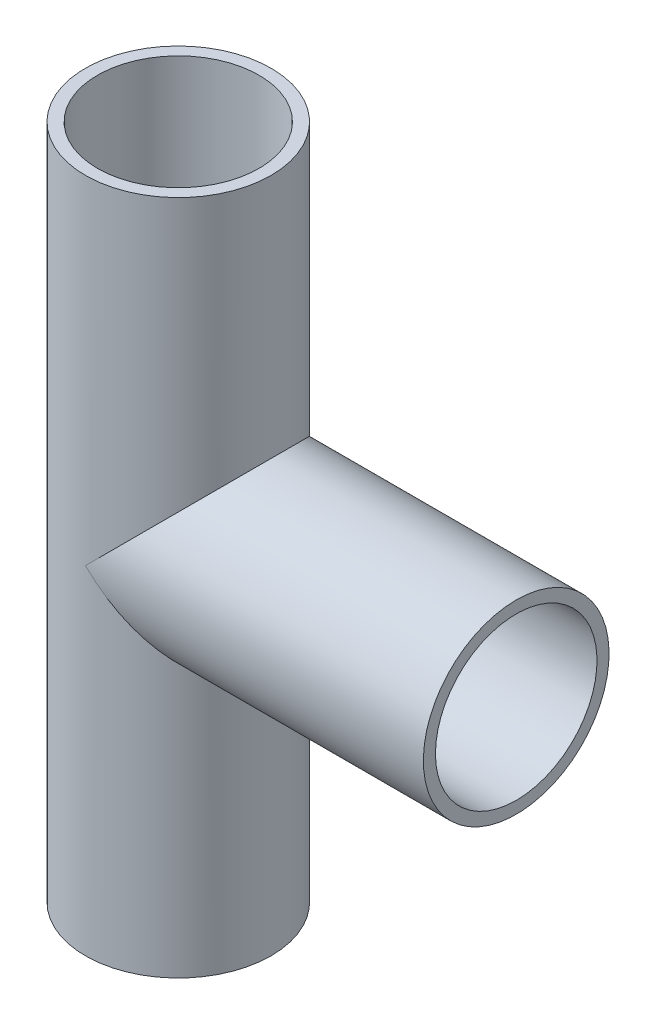
ISO-10303-21;
HEADER;
FILE_DESCRIPTION(('STEP AP214'),'2;1');
FILE_NAME('part.step','',(''),(''),'','','');
FILE_SCHEMA(('AUTOMOTIVE_DESIGN { 1 0 10303 214 1 1 1 1 }'));
ENDSEC;
DATA;
#1=APPLICATION_CONTEXT('core data for automotive mechanical design processes');
#2=APPLICATION_PROTOCOL_DEFINITION('international standard','automotive_design',2000,#1);
#3=PRODUCT_CONTEXT('',#1,'mechanical');
#4=PRODUCT('Part','Part','',(#3));
#5=PRODUCT_RELATED_PRODUCT_CATEGORY('part','',(#4));
#6=PRODUCT_DEFINITION_FORMATION('','',#4);
#7=PRODUCT_DEFINITION_CONTEXT('part definition',#1,'design');
#8=PRODUCT_DEFINITION('design','',#6,#7);
#9=PRODUCT_DEFINITION_SHAPE('','',#8);
#10=(LENGTH_UNIT() NAMED_UNIT(*) SI_UNIT(.MILLI.,.METRE.));
#11=(NAMED_UNIT(*) PLANE_ANGLE_UNIT() SI_UNIT($,.RADIAN.));
#12=(NAMED_UNIT(*) SI_UNIT($,.STERADIAN.) SOLID_ANGLE_UNIT());
#13=UNCERTAINTY_MEASURE_WITH_UNIT(LENGTH_MEASURE(1.E-05),#10,'distance_accuracy_value','');
#14=(GEOMETRIC_REPRESENTATION_CONTEXT(3) GLOBAL_UNCERTAINTY_ASSIGNED_CONTEXT((#13)) GLOBAL_UNIT_ASSIGNED_CONTEXT((#10,
#11,#12)) REPRESENTATION_CONTEXT('',''));
#15=CARTESIAN_POINT('',(0.,0.,0.));
#16=DIRECTION('',(0.,0.,1.));
#17=DIRECTION('',(1.,0.,0.));
#18=AXIS2_PLACEMENT_3D('',#15,#16,#17);
#19=CARTESIAN_POINT('',(0.,-46.228,0.));
#20=DIRECTION('',(0.,-1.,0.));
#21=DIRECTION('',(0.,0.,1.));
#22=AXIS2_PLACEMENT_3D('',#19,#20,#21);
#23=CYLINDRICAL_SURFACE('',#22,12.7);
#24=CARTESIAN_POINT('',(0.,0.,0.));
#25=DIRECTION('',(0.707106781186548,-0.707106781186548,0.));
#26=DIRECTION('',(0.707106781186548,0.707106781186548,0.));
#27=AXIS2_PLACEMENT_3D('',#24,#25,#26);
#28=ELLIPSE('',#27,17.9605122421383,12.7);
#29=CARTESIAN_POINT('',(0.,0.,-12.7));
#30=VERTEX_POINT('',#29);
#31=CARTESIAN_POINT('',(0.,0.,12.7));
#32=VERTEX_POINT('',#31);
#33=EDGE_CURVE('E34',#30,#32,#28,.T.);
#34=ORIENTED_EDGE('',*,*,#33,.F.);
#35=CARTESIAN_POINT('',(0.,0.,0.));
#36=DIRECTION('',(0.707106781186548,0.707106781186548,0.));
#37=DIRECTION('',(-0.707106781186548,0.707106781186548,0.));
#38=AXIS2_PLACEMENT_3D('',#35,#36,#37);
#39=ELLIPSE('',#38,17.9605122421383,12.7);
#40=EDGE_CURVE('E60',#32,#30,#39,.T.);
#41=ORIENTED_EDGE('',*,*,#40,.F.);
#42=EDGE_LOOP('',(#34,#41));
#43=FACE_BOUND('',#42,.T.);
#44=CARTESIAN_POINT('',(0.,-46.228,0.));
#45=DIRECTION('',(0.,1.,0.));
#46=DIRECTION('',(1.,0.,0.));
#47=AXIS2_PLACEMENT_3D('',#44,#45,#46);
#48=CIRCLE('',#47,12.7);
#49=CARTESIAN_POINT('',(12.7,-46.228,0.));
#50=VERTEX_POINT('',#49);
#51=EDGE_CURVE('E11',#50,#50,#48,.T.);
#52=ORIENTED_EDGE('',*,*,#51,.T.);
#53=EDGE_LOOP('',(#52));
#54=FACE_BOUND('',#53,.T.);
#55=CARTESIAN_POINT('',(0.,46.228,0.));
#56=DIRECTION('',(0.,1.,0.));
#57=DIRECTION('',(1.,0.,0.));
#58=AXIS2_PLACEMENT_3D('',#55,#56,#57);
#59=CIRCLE('',#58,12.7);
#60=CARTESIAN_POINT('',(12.7,46.228,0.));
#61=VERTEX_POINT('',#60);
#62=EDGE_CURVE('E55',#61,#61,#59,.T.);
#63=ORIENTED_EDGE('',*,*,#62,.F.);
#64=EDGE_LOOP('',(#63));
#65=FACE_BOUND('',#64,.T.);
#66=ADVANCED_FACE('F16',(#43,#54,#65),#23,.T.);
#67=CARTESIAN_POINT('',(46.228,0.,0.));
#68=DIRECTION('',(1.,0.,0.));
#69=DIRECTION('',(0.,0.,1.));
#70=AXIS2_PLACEMENT_3D('',#67,#68,#69);
#71=CYLINDRICAL_SURFACE('',#70,11.049);
#72=CARTESIAN_POINT('',(46.228,0.,0.));
#73=DIRECTION('',(-1.,0.,0.));
#74=DIRECTION('',(0.,-1.,0.));
#75=AXIS2_PLACEMENT_3D('',#72,#73,#74);
#76=CIRCLE('',#75,11.049);
#77=CARTESIAN_POINT('',(46.228,-11.049,0.));
#78=VERTEX_POINT('',#77);
#79=EDGE_CURVE('E65',#78,#78,#76,.T.);
#80=ORIENTED_EDGE('',*,*,#79,.F.);
#81=EDGE_LOOP('',(#80));
#82=FACE_BOUND('',#81,.T.);
#83=CARTESIAN_POINT('',(0.,0.,0.));
#84=DIRECTION('',(0.707106781186548,0.707106781186548,0.));
#85=DIRECTION('',(-0.707106781186548,0.707106781186548,0.));
#86=AXIS2_PLACEMENT_3D('',#83,#84,#85);
#87=ELLIPSE('',#86,15.6256456506603,11.049);
#88=CARTESIAN_POINT('',(0.,0.,11.049));
#89=VERTEX_POINT('',#88);
#90=CARTESIAN_POINT('',(0.,0.,-11.049));
#91=VERTEX_POINT('',#90);
#92=EDGE_CURVE('E42',#89,#91,#87,.T.);
#93=ORIENTED_EDGE('',*,*,#92,.F.);
#94=CARTESIAN_POINT('',(0.,0.,0.));
#95=DIRECTION('',(0.707106781186548,-0.707106781186548,0.));
#96=DIRECTION('',(0.707106781186548,0.707106781186548,0.));
#97=AXIS2_PLACEMENT_3D('',#94,#95,#96);
#98=ELLIPSE('',#97,15.6256456506603,11.049);
#99=EDGE_CURVE('E26',#91,#89,#98,.T.);
#100=ORIENTED_EDGE('',*,*,#99,.F.);
#101=EDGE_LOOP('',(#93,#100));
#102=FACE_BOUND('',#101,.T.);
#103=ADVANCED_FACE('F49',(#82,#102),#71,.F.);
#104=CARTESIAN_POINT('',(0.,-46.228,0.));
#105=DIRECTION('',(0.,-1.,0.));
#106=DIRECTION('',(0.,0.,1.));
#107=AXIS2_PLACEMENT_3D('',#104,#105,#106);
#108=CYLINDRICAL_SURFACE('',#107,11.049);
#109=ORIENTED_EDGE('',*,*,#99,.T.);
#110=ORIENTED_EDGE('',*,*,#92,.T.);
#111=EDGE_LOOP('',(#109,#110));
#112=FACE_BOUND('',#111,.T.);
#113=CARTESIAN_POINT('',(0.,-46.228,0.));
#114=DIRECTION('',(0.,1.,0.));
#115=DIRECTION('',(0.,0.,1.));
#116=AXIS2_PLACEMENT_3D('',#113,#114,#115);
#117=CIRCLE('',#116,11.049);
#118=CARTESIAN_POINT('',(0.,-46.228,11.049));
#119=VERTEX_POINT('',#118);
#120=EDGE_CURVE('E53',#119,#119,#117,.T.);
#121=ORIENTED_EDGE('',*,*,#120,.F.);
#122=EDGE_LOOP('',(#121));
#123=FACE_BOUND('',#122,.T.);
#124=CARTESIAN_POINT('',(0.,46.228,0.));
#125=DIRECTION('',(0.,1.,0.));
#126=DIRECTION('',(0.,0.,1.));
#127=AXIS2_PLACEMENT_3D('',#124,#125,#126);
#128=CIRCLE('',#127,11.049);
#129=CARTESIAN_POINT('',(0.,46.228,11.049));
#130=VERTEX_POINT('',#129);
#131=EDGE_CURVE('E47',#130,#130,#128,.T.);
#132=ORIENTED_EDGE('',*,*,#131,.T.);
#133=EDGE_LOOP('',(#132));
#134=FACE_BOUND('',#133,.T.);
#135=ADVANCED_FACE('F45',(#112,#123,#134),#108,.F.);
#136=CARTESIAN_POINT('',(46.228,0.,0.));
#137=DIRECTION('',(1.,0.,0.));
#138=DIRECTION('',(0.,0.,1.));
#139=AXIS2_PLACEMENT_3D('',#136,#137,#138);
#140=CYLINDRICAL_SURFACE('',#139,12.7);
#141=CARTESIAN_POINT('',(46.228,0.,0.));
#142=DIRECTION('',(-1.,0.,0.));
#143=DIRECTION('',(0.,1.,0.));
#144=AXIS2_PLACEMENT_3D('',#141,#142,#143);
#145=CIRCLE('',#144,12.7);
#146=CARTESIAN_POINT('',(46.228,12.7,0.));
#147=VERTEX_POINT('',#146);
#148=EDGE_CURVE('E20',#147,#147,#145,.T.);
#149=ORIENTED_EDGE('',*,*,#148,.T.);
#150=EDGE_LOOP('',(#149));
#151=FACE_BOUND('',#150,.T.);
#152=ORIENTED_EDGE('',*,*,#40,.T.);
#153=ORIENTED_EDGE('',*,*,#33,.T.);
#154=EDGE_LOOP('',(#152,#153));
#155=FACE_BOUND('',#154,.T.);
#156=ADVANCED_FACE('F82',(#151,#155),#140,.T.);
#157=CARTESIAN_POINT('',(46.228,0.,0.));
#158=DIRECTION('',(-1.,0.,0.));
#159=DIRECTION('',(0.,-1.,0.));
#160=AXIS2_PLACEMENT_3D('',#157,#158,#159);
#161=PLANE('',#160);
#162=ORIENTED_EDGE('',*,*,#79,.T.);
#163=EDGE_LOOP('',(#162));
#164=FACE_BOUND('',#163,.T.);
#165=ORIENTED_EDGE('',*,*,#148,.F.);
#166=EDGE_LOOP('',(#165));
#167=FACE_BOUND('',#166,.T.);
#168=ADVANCED_FACE('F72',(#164,#167),#161,.F.);
#169=CARTESIAN_POINT('',(0.,46.228,0.));
#170=DIRECTION('',(0.,1.,0.));
#171=DIRECTION('',(0.,0.,1.));
#172=AXIS2_PLACEMENT_3D('',#169,#170,#171);
#173=PLANE('',#172);
#174=ORIENTED_EDGE('',*,*,#131,.F.);
#175=EDGE_LOOP('',(#174));
#176=FACE_BOUND('',#175,.T.);
#177=ORIENTED_EDGE('',*,*,#62,.T.);
#178=EDGE_LOOP('',(#177));
#179=FACE_BOUND('',#178,.T.);
#180=ADVANCED_FACE('F89',(#176,#179),#173,.T.);
#181=CARTESIAN_POINT('',(0.,-46.228,0.));
#182=DIRECTION('',(0.,1.,0.));
#183=DIRECTION('',(0.,0.,1.));
#184=AXIS2_PLACEMENT_3D('',#181,#182,#183);
#185=PLANE('',#184);
#186=ORIENTED_EDGE('',*,*,#120,.T.);
#187=EDGE_LOOP('',(#186));
#188=FACE_BOUND('',#187,.T.);
#189=ORIENTED_EDGE('',*,*,#51,.F.);
#190=EDGE_LOOP('',(#189));
#191=FACE_BOUND('',#190,.T.);
#192=ADVANCED_FACE('F18',(#188,#191),#185,.F.);
#193=CLOSED_SHELL('',(#66,#103,#135,#156,#168,#180,#192));
#194=MANIFOLD_SOLID_BREP('B1',#193);
#195=ADVANCED_BREP_SHAPE_REPRESENTATION('',(#18,#194),#14);
#196=SHAPE_DEFINITION_REPRESENTATION(#9,#195);
ENDSEC;
END-ISO-10303-21;
